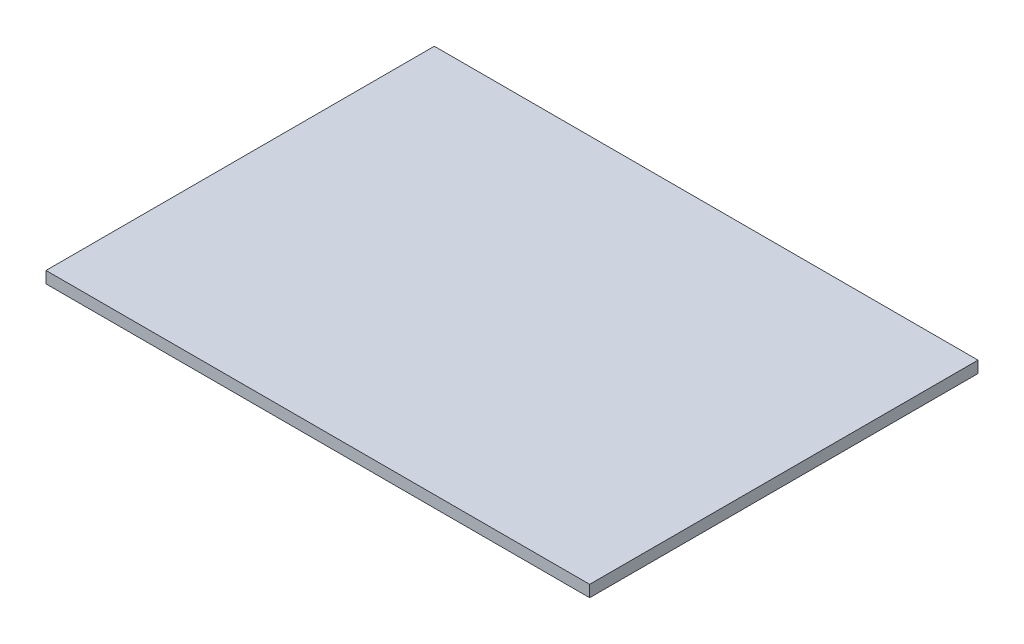
ISO-10303-21;
HEADER;
FILE_DESCRIPTION(('STEP AP214'),'2;1');
FILE_NAME('part.step','',(''),(''),'','','');
FILE_SCHEMA(('AUTOMOTIVE_DESIGN { 1 0 10303 214 1 1 1 1 }'));
ENDSEC;
DATA;
#1=APPLICATION_CONTEXT('core data for automotive mechanical design processes');
#2=APPLICATION_PROTOCOL_DEFINITION('international standard','automotive_design',2000,#1);
#3=PRODUCT_CONTEXT('',#1,'mechanical');
#4=PRODUCT('Part','Part','',(#3));
#5=PRODUCT_RELATED_PRODUCT_CATEGORY('part','',(#4));
#6=PRODUCT_DEFINITION_FORMATION('','',#4);
#7=PRODUCT_DEFINITION_CONTEXT('part definition',#1,'design');
#8=PRODUCT_DEFINITION('design','',#6,#7);
#9=PRODUCT_DEFINITION_SHAPE('','',#8);
#10=(LENGTH_UNIT() NAMED_UNIT(*) SI_UNIT(.MILLI.,.METRE.));
#11=(NAMED_UNIT(*) PLANE_ANGLE_UNIT() SI_UNIT($,.RADIAN.));
#12=(NAMED_UNIT(*) SI_UNIT($,.STERADIAN.) SOLID_ANGLE_UNIT());
#13=UNCERTAINTY_MEASURE_WITH_UNIT(LENGTH_MEASURE(1.E-05),#10,'distance_accuracy_value','');
#14=(GEOMETRIC_REPRESENTATION_CONTEXT(3) GLOBAL_UNCERTAINTY_ASSIGNED_CONTEXT((#13)) GLOBAL_UNIT_ASSIGNED_CONTEXT((#10,
#11,#12)) REPRESENTATION_CONTEXT('',''));
#15=CARTESIAN_POINT('',(0.,0.,0.));
#16=DIRECTION('',(0.,0.,1.));
#17=DIRECTION('',(1.,0.,0.));
#18=AXIS2_PLACEMENT_3D('',#15,#16,#17);
#19=CARTESIAN_POINT('',(35.,1.5,25.));
#20=DIRECTION('',(-1.,0.,0.));
#21=DIRECTION('',(0.,0.,1.));
#22=AXIS2_PLACEMENT_3D('',#19,#20,#21);
#23=PLANE('',#22);
#24=DIRECTION('',(0.,0.,-1.));
#25=VECTOR('',#24,1.);
#26=CARTESIAN_POINT('',(35.,0.,25.));
#27=LINE('',#26,#25);
#28=CARTESIAN_POINT('',(35.,0.,25.));
#29=VERTEX_POINT('',#28);
#30=CARTESIAN_POINT('',(35.,0.,-25.));
#31=VERTEX_POINT('',#30);
#32=EDGE_CURVE('E96',#29,#31,#27,.T.);
#33=ORIENTED_EDGE('',*,*,#32,.T.);
#34=DIRECTION('',(0.,-1.,0.));
#35=VECTOR('',#34,1.);
#36=CARTESIAN_POINT('',(35.,1.5,-25.));
#37=LINE('',#36,#35);
#38=CARTESIAN_POINT('',(35.,1.5,-25.));
#39=VERTEX_POINT('',#38);
#40=EDGE_CURVE('E11',#39,#31,#37,.T.);
#41=ORIENTED_EDGE('',*,*,#40,.F.);
#42=DIRECTION('',(0.,0.,-1.));
#43=VECTOR('',#42,1.);
#44=CARTESIAN_POINT('',(35.,1.5,25.));
#45=LINE('',#44,#43);
#46=CARTESIAN_POINT('',(35.,1.5,25.));
#47=VERTEX_POINT('',#46);
#48=EDGE_CURVE('E84',#47,#39,#45,.T.);
#49=ORIENTED_EDGE('',*,*,#48,.F.);
#50=DIRECTION('',(0.,-1.,0.));
#51=VECTOR('',#50,1.);
#52=CARTESIAN_POINT('',(35.,1.5,25.));
#53=LINE('',#52,#51);
#54=EDGE_CURVE('E92',#47,#29,#53,.T.);
#55=ORIENTED_EDGE('',*,*,#54,.T.);
#56=EDGE_LOOP('',(#33,#41,#49,#55));
#57=FACE_BOUND('',#56,.T.);
#58=ADVANCED_FACE('F33',(#57),#23,.F.);
#59=CARTESIAN_POINT('',(-35.,1.5,-25.));
#60=DIRECTION('',(0.,0.,1.));
#61=DIRECTION('',(1.,0.,0.));
#62=AXIS2_PLACEMENT_3D('',#59,#60,#61);
#63=PLANE('',#62);
#64=DIRECTION('',(-1.,0.,0.));
#65=VECTOR('',#64,1.);
#66=CARTESIAN_POINT('',(-35.,0.,-25.));
#67=LINE('',#66,#65);
#68=CARTESIAN_POINT('',(-35.,0.,-25.));
#69=VERTEX_POINT('',#68);
#70=EDGE_CURVE('E88',#31,#69,#67,.T.);
#71=ORIENTED_EDGE('',*,*,#70,.T.);
#72=DIRECTION('',(0.,-1.,0.));
#73=VECTOR('',#72,1.);
#74=CARTESIAN_POINT('',(-35.,1.5,-25.));
#75=LINE('',#74,#73);
#76=CARTESIAN_POINT('',(-35.,1.5,-25.));
#77=VERTEX_POINT('',#76);
#78=EDGE_CURVE('E41',#77,#69,#75,.T.);
#79=ORIENTED_EDGE('',*,*,#78,.F.);
#80=DIRECTION('',(-1.,0.,0.));
#81=VECTOR('',#80,1.);
#82=CARTESIAN_POINT('',(-35.,1.5,-25.));
#83=LINE('',#82,#81);
#84=EDGE_CURVE('E79',#39,#77,#83,.T.);
#85=ORIENTED_EDGE('',*,*,#84,.F.);
#86=ORIENTED_EDGE('',*,*,#40,.T.);
#87=EDGE_LOOP('',(#71,#79,#85,#86));
#88=FACE_BOUND('',#87,.T.);
#89=ADVANCED_FACE('F87',(#88),#63,.F.);
#90=CARTESIAN_POINT('',(-35.,1.5,25.));
#91=DIRECTION('',(1.,0.,0.));
#92=DIRECTION('',(0.,0.,-1.));
#93=AXIS2_PLACEMENT_3D('',#90,#91,#92);
#94=PLANE('',#93);
#95=DIRECTION('',(0.,0.,1.));
#96=VECTOR('',#95,1.);
#97=CARTESIAN_POINT('',(-35.,0.,25.));
#98=LINE('',#97,#96);
#99=CARTESIAN_POINT('',(-35.,0.,25.));
#100=VERTEX_POINT('',#99);
#101=EDGE_CURVE('E66',#69,#100,#98,.T.);
#102=ORIENTED_EDGE('',*,*,#101,.T.);
#103=DIRECTION('',(0.,-1.,0.));
#104=VECTOR('',#103,1.);
#105=CARTESIAN_POINT('',(-35.,1.5,25.));
#106=LINE('',#105,#104);
#107=CARTESIAN_POINT('',(-35.,1.5,25.));
#108=VERTEX_POINT('',#107);
#109=EDGE_CURVE('E89',#108,#100,#106,.T.);
#110=ORIENTED_EDGE('',*,*,#109,.F.);
#111=DIRECTION('',(0.,0.,1.));
#112=VECTOR('',#111,1.);
#113=CARTESIAN_POINT('',(-35.,1.5,25.));
#114=LINE('',#113,#112);
#115=EDGE_CURVE('E82',#77,#108,#114,.T.);
#116=ORIENTED_EDGE('',*,*,#115,.F.);
#117=ORIENTED_EDGE('',*,*,#78,.T.);
#118=EDGE_LOOP('',(#102,#110,#116,#117));
#119=FACE_BOUND('',#118,.T.);
#120=ADVANCED_FACE('F90',(#119),#94,.F.);
#121=CARTESIAN_POINT('',(-35.,1.5,25.));
#122=DIRECTION('',(0.,0.,-1.));
#123=DIRECTION('',(-1.,0.,0.));
#124=AXIS2_PLACEMENT_3D('',#121,#122,#123);
#125=PLANE('',#124);
#126=DIRECTION('',(1.,0.,0.));
#127=VECTOR('',#126,1.);
#128=CARTESIAN_POINT('',(-35.,0.,25.));
#129=LINE('',#128,#127);
#130=EDGE_CURVE('E72',#100,#29,#129,.T.);
#131=ORIENTED_EDGE('',*,*,#130,.T.);
#132=ORIENTED_EDGE('',*,*,#54,.F.);
#133=DIRECTION('',(1.,0.,0.));
#134=VECTOR('',#133,1.);
#135=CARTESIAN_POINT('',(-35.,1.5,25.));
#136=LINE('',#135,#134);
#137=EDGE_CURVE('E49',#108,#47,#136,.T.);
#138=ORIENTED_EDGE('',*,*,#137,.F.);
#139=ORIENTED_EDGE('',*,*,#109,.T.);
#140=EDGE_LOOP('',(#131,#132,#138,#139));
#141=FACE_BOUND('',#140,.T.);
#142=ADVANCED_FACE('F103',(#141),#125,.F.);
#143=CARTESIAN_POINT('',(0.,1.5,0.));
#144=DIRECTION('',(0.,-1.,0.));
#145=DIRECTION('',(0.,0.,-1.));
#146=AXIS2_PLACEMENT_3D('',#143,#144,#145);
#147=PLANE('',#146);
#148=ORIENTED_EDGE('',*,*,#48,.T.);
#149=ORIENTED_EDGE('',*,*,#84,.T.);
#150=ORIENTED_EDGE('',*,*,#115,.T.);
#151=ORIENTED_EDGE('',*,*,#137,.T.);
#152=EDGE_LOOP('',(#148,#149,#150,#151));
#153=FACE_BOUND('',#152,.T.);
#154=ADVANCED_FACE('F80',(#153),#147,.F.);
#155=CARTESIAN_POINT('',(0.,0.,0.));
#156=DIRECTION('',(0.,-1.,0.));
#157=DIRECTION('',(0.,0.,-1.));
#158=AXIS2_PLACEMENT_3D('',#155,#156,#157);
#159=PLANE('',#158);
#160=ORIENTED_EDGE('',*,*,#32,.F.);
#161=ORIENTED_EDGE('',*,*,#130,.F.);
#162=ORIENTED_EDGE('',*,*,#101,.F.);
#163=ORIENTED_EDGE('',*,*,#70,.F.);
#164=EDGE_LOOP('',(#160,#161,#162,#163));
#165=FACE_BOUND('',#164,.T.);
#166=ADVANCED_FACE('F106',(#165),#159,.T.);
#167=CLOSED_SHELL('',(#58,#89,#120,#142,#154,#166));
#168=MANIFOLD_SOLID_BREP('B2',#167);
#169=ADVANCED_BREP_SHAPE_REPRESENTATION('',(#18,#168),#14);
#170=SHAPE_DEFINITION_REPRESENTATION(#9,#169);
ENDSEC;
END-ISO-10303-21;
